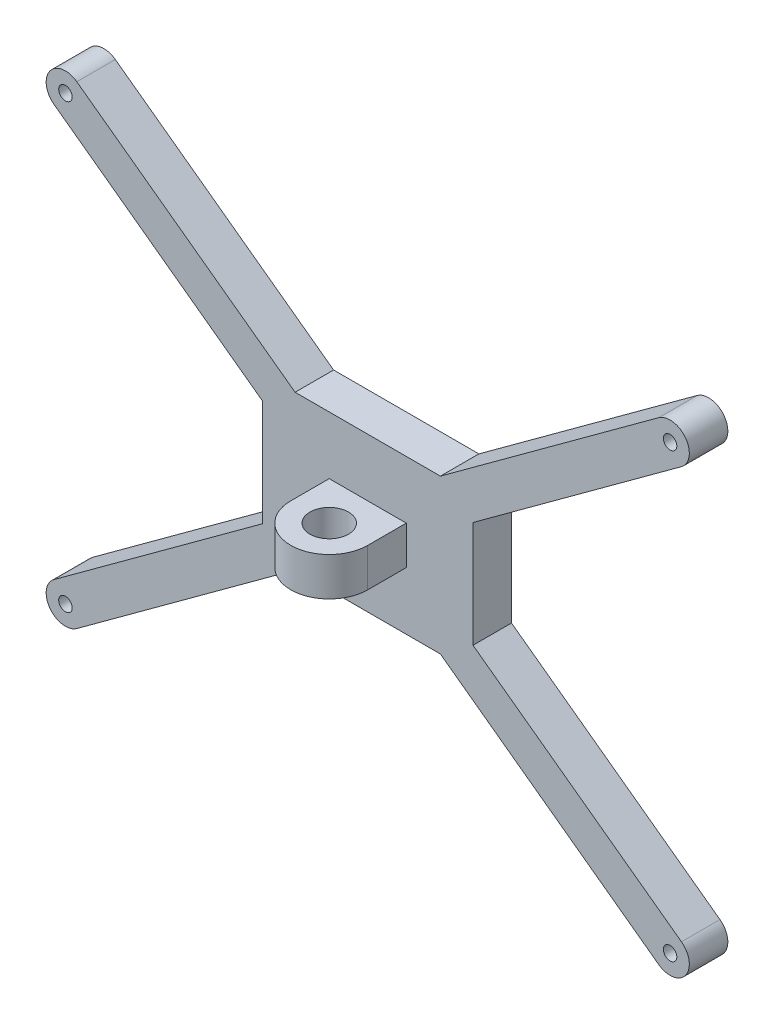
ISO-10303-21;
HEADER;
FILE_DESCRIPTION(('STEP AP214'),'2;1');
FILE_NAME('part.step','',(''),(''),'','','');
FILE_SCHEMA(('AUTOMOTIVE_DESIGN { 1 0 10303 214 1 1 1 1 }'));
ENDSEC;
DATA;
#1=APPLICATION_CONTEXT('core data for automotive mechanical design processes');
#2=APPLICATION_PROTOCOL_DEFINITION('international standard','automotive_design',2000,#1);
#3=PRODUCT_CONTEXT('',#1,'mechanical');
#4=PRODUCT('Part','Part','',(#3));
#5=PRODUCT_RELATED_PRODUCT_CATEGORY('part','',(#4));
#6=PRODUCT_DEFINITION_FORMATION('','',#4);
#7=PRODUCT_DEFINITION_CONTEXT('part definition',#1,'design');
#8=PRODUCT_DEFINITION('design','',#6,#7);
#9=PRODUCT_DEFINITION_SHAPE('','',#8);
#10=(LENGTH_UNIT() NAMED_UNIT(*) SI_UNIT(.MILLI.,.METRE.));
#11=(NAMED_UNIT(*) PLANE_ANGLE_UNIT() SI_UNIT($,.RADIAN.));
#12=(NAMED_UNIT(*) SI_UNIT($,.STERADIAN.) SOLID_ANGLE_UNIT());
#13=UNCERTAINTY_MEASURE_WITH_UNIT(LENGTH_MEASURE(1.E-05),#10,'distance_accuracy_value','');
#14=(GEOMETRIC_REPRESENTATION_CONTEXT(3) GLOBAL_UNCERTAINTY_ASSIGNED_CONTEXT((#13)) GLOBAL_UNIT_ASSIGNED_CONTEXT((#10,
#11,#12)) REPRESENTATION_CONTEXT('',''));
#15=CARTESIAN_POINT('',(0.,0.,0.));
#16=DIRECTION('',(0.,0.,1.));
#17=DIRECTION('',(1.,0.,0.));
#18=AXIS2_PLACEMENT_3D('',#15,#16,#17);
#19=CARTESIAN_POINT('',(157.,0.,10.));
#20=DIRECTION('',(0.,0.,1.));
#21=DIRECTION('',(1.,0.,0.));
#22=AXIS2_PLACEMENT_3D('',#19,#20,#21);
#23=PLANE('',#22);
#24=CARTESIAN_POINT('',(157.,0.,10.));
#25=DIRECTION('',(0.,0.,1.));
#26=DIRECTION('',(1.,0.,0.));
#27=AXIS2_PLACEMENT_3D('',#24,#25,#26);
#28=CIRCLE('',#27,1.75000000000001);
#29=CARTESIAN_POINT('',(158.75,0.,10.));
#30=VERTEX_POINT('',#29);
#31=EDGE_CURVE('E380',#30,#30,#28,.T.);
#32=ORIENTED_EDGE('',*,*,#31,.F.);
#33=EDGE_LOOP('',(#32));
#34=FACE_BOUND('',#33,.T.);
#35=CARTESIAN_POINT('',(0.,0.,10.));
#36=DIRECTION('',(0.,0.,1.));
#37=DIRECTION('',(1.,0.,0.));
#38=AXIS2_PLACEMENT_3D('',#35,#36,#37);
#39=CIRCLE('',#38,1.75);
#40=CARTESIAN_POINT('',(1.75,0.,10.));
#41=VERTEX_POINT('',#40);
#42=EDGE_CURVE('E206',#41,#41,#39,.T.);
#43=ORIENTED_EDGE('',*,*,#42,.F.);
#44=EDGE_LOOP('',(#43));
#45=FACE_BOUND('',#44,.T.);
#46=DIRECTION('',(-0.806976552685841,0.590583477093015,0.));
#47=VECTOR('',#46,1.);
#48=CARTESIAN_POINT('',(105.828111401218,43.6459668882059,10.));
#49=LINE('',#48,#47);
#50=CARTESIAN_POINT('',(159.952917385465,4.03488276342919,10.));
#51=VERTEX_POINT('',#50);
#52=CARTESIAN_POINT('',(105.828111401218,43.6459668882059,10.));
#53=VERTEX_POINT('',#52);
#54=EDGE_CURVE('E249',#51,#53,#49,.T.);
#55=ORIENTED_EDGE('',*,*,#54,.T.);
#56=DIRECTION('',(0.,1.,0.));
#57=VECTOR('',#56,1.);
#58=CARTESIAN_POINT('',(105.828111401218,43.6459668882059,10.));
#59=LINE('',#58,#57);
#60=CARTESIAN_POINT('',(105.828111401218,71.2540331117941,10.));
#61=VERTEX_POINT('',#60);
#62=EDGE_CURVE('E129',#53,#61,#59,.T.);
#63=ORIENTED_EDGE('',*,*,#62,.T.);
#64=DIRECTION('',(0.806976552685841,0.590583477093015,0.));
#65=VECTOR('',#64,1.);
#66=CARTESIAN_POINT('',(159.952917385465,110.865117236571,10.));
#67=LINE('',#66,#65);
#68=CARTESIAN_POINT('',(159.952917385465,110.865117236571,10.));
#69=VERTEX_POINT('',#68);
#70=EDGE_CURVE('E302',#61,#69,#67,.T.);
#71=ORIENTED_EDGE('',*,*,#70,.T.);
#72=CARTESIAN_POINT('',(157.,114.9,10.));
#73=DIRECTION('',(0.,0.,1.));
#74=DIRECTION('',(1.,0.,0.));
#75=AXIS2_PLACEMENT_3D('',#72,#73,#74);
#76=CIRCLE('',#75,4.99999999999994);
#77=CARTESIAN_POINT('',(154.047082614535,118.934882763429,10.));
#78=VERTEX_POINT('',#77);
#79=EDGE_CURVE('E322',#69,#78,#76,.T.);
#80=ORIENTED_EDGE('',*,*,#79,.T.);
#81=DIRECTION('',(-0.806976552685842,-0.590583477093013,0.));
#82=VECTOR('',#81,1.);
#83=CARTESIAN_POINT('',(154.047082614535,118.934882763429,10.));
#84=LINE('',#83,#82);
#85=CARTESIAN_POINT('',(97.3619077332609,77.45,10.));
#86=VERTEX_POINT('',#85);
#87=EDGE_CURVE('E318',#78,#86,#84,.T.);
#88=ORIENTED_EDGE('',*,*,#87,.T.);
#89=DIRECTION('',(-1.,0.,0.));
#90=VECTOR('',#89,1.);
#91=CARTESIAN_POINT('',(59.6380922667391,77.45,10.));
#92=LINE('',#91,#90);
#93=CARTESIAN_POINT('',(59.6380922667391,77.45,10.));
#94=VERTEX_POINT('',#93);
#95=EDGE_CURVE('E321',#86,#94,#92,.T.);
#96=ORIENTED_EDGE('',*,*,#95,.T.);
#97=DIRECTION('',(-0.806976552685842,0.590583477093014,0.));
#98=VECTOR('',#97,1.);
#99=CARTESIAN_POINT('',(2.95291738546507,118.934882763429,10.));
#100=LINE('',#99,#98);
#101=CARTESIAN_POINT('',(2.95291738546507,118.934882763429,10.));
#102=VERTEX_POINT('',#101);
#103=EDGE_CURVE('E326',#94,#102,#100,.T.);
#104=ORIENTED_EDGE('',*,*,#103,.T.);
#105=CARTESIAN_POINT('',(0.,114.9,10.));
#106=DIRECTION('',(0.,0.,1.));
#107=DIRECTION('',(1.,0.,0.));
#108=AXIS2_PLACEMENT_3D('',#105,#106,#107);
#109=CIRCLE('',#108,4.99999999999999);
#110=CARTESIAN_POINT('',(-2.95291738546507,110.865117236571,10.));
#111=VERTEX_POINT('',#110);
#112=EDGE_CURVE('E333',#102,#111,#109,.T.);
#113=ORIENTED_EDGE('',*,*,#112,.T.);
#114=DIRECTION('',(0.806976552685842,-0.590583477093014,0.));
#115=VECTOR('',#114,1.);
#116=CARTESIAN_POINT('',(-2.95291738546506,110.865117236571,10.));
#117=LINE('',#116,#115);
#118=CARTESIAN_POINT('',(51.1718885987816,71.2540331117941,10.));
#119=VERTEX_POINT('',#118);
#120=EDGE_CURVE('E336',#111,#119,#117,.T.);
#121=ORIENTED_EDGE('',*,*,#120,.T.);
#122=DIRECTION('',(0.,-1.,0.));
#123=VECTOR('',#122,1.);
#124=CARTESIAN_POINT('',(51.1718885987816,43.6459668882059,10.));
#125=LINE('',#124,#123);
#126=CARTESIAN_POINT('',(51.1718885987816,43.6459668882059,10.));
#127=VERTEX_POINT('',#126);
#128=EDGE_CURVE('E339',#119,#127,#125,.T.);
#129=ORIENTED_EDGE('',*,*,#128,.T.);
#130=DIRECTION('',(-0.806976552685842,-0.590583477093014,0.));
#131=VECTOR('',#130,1.);
#132=CARTESIAN_POINT('',(51.1718885987816,43.6459668882059,10.));
#133=LINE('',#132,#131);
#134=CARTESIAN_POINT('',(-2.95291738546507,4.0348827634292,10.));
#135=VERTEX_POINT('',#134);
#136=EDGE_CURVE('E342',#127,#135,#133,.T.);
#137=ORIENTED_EDGE('',*,*,#136,.T.);
#138=CARTESIAN_POINT('',(0.,0.,10.));
#139=DIRECTION('',(0.,0.,1.));
#140=DIRECTION('',(1.,0.,0.));
#141=AXIS2_PLACEMENT_3D('',#138,#139,#140);
#142=CIRCLE('',#141,5.);
#143=CARTESIAN_POINT('',(2.95291738546507,-4.03488276342921,10.));
#144=VERTEX_POINT('',#143);
#145=EDGE_CURVE('E345',#135,#144,#142,.T.);
#146=ORIENTED_EDGE('',*,*,#145,.T.);
#147=DIRECTION('',(0.806976552685842,0.590583477093014,0.));
#148=VECTOR('',#147,1.);
#149=CARTESIAN_POINT('',(59.6380922667391,37.45,10.));
#150=LINE('',#149,#148);
#151=CARTESIAN_POINT('',(59.6380922667391,37.45,10.));
#152=VERTEX_POINT('',#151);
#153=EDGE_CURVE('E176',#144,#152,#150,.T.);
#154=ORIENTED_EDGE('',*,*,#153,.T.);
#155=DIRECTION('',(1.,0.,0.));
#156=VECTOR('',#155,1.);
#157=CARTESIAN_POINT('',(59.6380922667391,37.45,10.));
#158=LINE('',#157,#156);
#159=CARTESIAN_POINT('',(97.3619077332609,37.45,10.));
#160=VERTEX_POINT('',#159);
#161=EDGE_CURVE('E169',#152,#160,#158,.T.);
#162=ORIENTED_EDGE('',*,*,#161,.T.);
#163=DIRECTION('',(0.806976552685842,-0.590583477093014,0.));
#164=VECTOR('',#163,1.);
#165=CARTESIAN_POINT('',(97.3619077332609,37.45,10.));
#166=LINE('',#165,#164);
#167=CARTESIAN_POINT('',(154.047082614535,-4.03488276342918,10.));
#168=VERTEX_POINT('',#167);
#169=EDGE_CURVE('E173',#160,#168,#166,.T.);
#170=ORIENTED_EDGE('',*,*,#169,.T.);
#171=CARTESIAN_POINT('',(157.,0.,10.));
#172=DIRECTION('',(0.,0.,1.));
#173=DIRECTION('',(1.,0.,0.));
#174=AXIS2_PLACEMENT_3D('',#171,#172,#173);
#175=CIRCLE('',#174,4.99999999999997);
#176=EDGE_CURVE('E64',#168,#51,#175,.T.);
#177=ORIENTED_EDGE('',*,*,#176,.T.);
#178=EDGE_LOOP('',(#55,#63,#71,#80,#88,#96,#104,#113,#121,#129,#137,#146,#154,#162,#170,#177));
#179=FACE_BOUND('',#178,.T.);
#180=CARTESIAN_POINT('',(0.,114.9,10.));
#181=DIRECTION('',(0.,0.,1.));
#182=DIRECTION('',(1.,0.,0.));
#183=AXIS2_PLACEMENT_3D('',#180,#181,#182);
#184=CIRCLE('',#183,1.75);
#185=CARTESIAN_POINT('',(1.75,114.9,10.));
#186=VERTEX_POINT('',#185);
#187=EDGE_CURVE('E372',#186,#186,#184,.T.);
#188=ORIENTED_EDGE('',*,*,#187,.F.);
#189=EDGE_LOOP('',(#188));
#190=FACE_BOUND('',#189,.T.);
#191=CARTESIAN_POINT('',(157.,114.9,10.));
#192=DIRECTION('',(0.,0.,1.));
#193=DIRECTION('',(1.,0.,0.));
#194=AXIS2_PLACEMENT_3D('',#191,#192,#193);
#195=CIRCLE('',#194,1.75000000000001);
#196=CARTESIAN_POINT('',(158.75,114.9,10.));
#197=VERTEX_POINT('',#196);
#198=EDGE_CURVE('E388',#197,#197,#195,.T.);
#199=ORIENTED_EDGE('',*,*,#198,.F.);
#200=EDGE_LOOP('',(#199));
#201=FACE_BOUND('',#200,.T.);
#202=DIRECTION('',(-1.,0.,0.));
#203=VECTOR('',#202,1.);
#204=CARTESIAN_POINT('',(88.5,62.45,9.99999999999999));
#205=LINE('',#204,#203);
#206=CARTESIAN_POINT('',(88.5,62.45,9.99999999999999));
#207=VERTEX_POINT('',#206);
#208=CARTESIAN_POINT('',(68.5,62.45,10.));
#209=VERTEX_POINT('',#208);
#210=EDGE_CURVE('E434',#207,#209,#205,.T.);
#211=ORIENTED_EDGE('',*,*,#210,.F.);
#212=DIRECTION('',(0.,-1.,0.));
#213=VECTOR('',#212,1.);
#214=CARTESIAN_POINT('',(88.5,62.45,9.99999999999999));
#215=LINE('',#214,#213);
#216=CARTESIAN_POINT('',(88.5,52.45,9.99999999999999));
#217=VERTEX_POINT('',#216);
#218=EDGE_CURVE('E403',#207,#217,#215,.T.);
#219=ORIENTED_EDGE('',*,*,#218,.T.);
#220=DIRECTION('',(-1.,0.,0.));
#221=VECTOR('',#220,1.);
#222=CARTESIAN_POINT('',(88.5,52.45,9.99999999999999));
#223=LINE('',#222,#221);
#224=CARTESIAN_POINT('',(68.5,52.45,9.99999999999999));
#225=VERTEX_POINT('',#224);
#226=EDGE_CURVE('E419',#217,#225,#223,.T.);
#227=ORIENTED_EDGE('',*,*,#226,.T.);
#228=DIRECTION('',(0.,-1.,0.));
#229=VECTOR('',#228,1.);
#230=CARTESIAN_POINT('',(68.5,62.45,9.99999999999999));
#231=LINE('',#230,#229);
#232=EDGE_CURVE('E407',#209,#225,#231,.T.);
#233=ORIENTED_EDGE('',*,*,#232,.F.);
#234=EDGE_LOOP('',(#211,#219,#227,#233));
#235=FACE_BOUND('',#234,.T.);
#236=ADVANCED_FACE('F39',(#34,#45,#179,#190,#201,#235),#23,.T.);
#237=CARTESIAN_POINT('',(157.,0.,0.));
#238=DIRECTION('',(0.,0.,1.));
#239=DIRECTION('',(1.,0.,0.));
#240=AXIS2_PLACEMENT_3D('',#237,#238,#239);
#241=PLANE('',#240);
#242=DIRECTION('',(-0.806976552685841,0.590583477093015,0.));
#243=VECTOR('',#242,1.);
#244=CARTESIAN_POINT('',(105.828111401218,43.6459668882059,0.));
#245=LINE('',#244,#243);
#246=CARTESIAN_POINT('',(159.952917385465,4.03488276342919,0.));
#247=VERTEX_POINT('',#246);
#248=CARTESIAN_POINT('',(105.828111401218,43.6459668882059,0.));
#249=VERTEX_POINT('',#248);
#250=EDGE_CURVE('E201',#247,#249,#245,.T.);
#251=ORIENTED_EDGE('',*,*,#250,.F.);
#252=CARTESIAN_POINT('',(157.,0.,0.));
#253=DIRECTION('',(0.,0.,1.));
#254=DIRECTION('',(1.,0.,0.));
#255=AXIS2_PLACEMENT_3D('',#252,#253,#254);
#256=CIRCLE('',#255,4.99999999999997);
#257=CARTESIAN_POINT('',(154.047082614535,-4.03488276342918,0.));
#258=VERTEX_POINT('',#257);
#259=EDGE_CURVE('E121',#258,#247,#256,.T.);
#260=ORIENTED_EDGE('',*,*,#259,.F.);
#261=DIRECTION('',(0.806976552685842,-0.590583477093014,0.));
#262=VECTOR('',#261,1.);
#263=CARTESIAN_POINT('',(97.3619077332609,37.45,0.));
#264=LINE('',#263,#262);
#265=CARTESIAN_POINT('',(97.3619077332609,37.45,0.));
#266=VERTEX_POINT('',#265);
#267=EDGE_CURVE('E244',#266,#258,#264,.T.);
#268=ORIENTED_EDGE('',*,*,#267,.F.);
#269=DIRECTION('',(1.,0.,0.));
#270=VECTOR('',#269,1.);
#271=CARTESIAN_POINT('',(59.6380922667391,37.45,0.));
#272=LINE('',#271,#270);
#273=CARTESIAN_POINT('',(59.6380922667391,37.45,0.));
#274=VERTEX_POINT('',#273);
#275=EDGE_CURVE('E186',#274,#266,#272,.T.);
#276=ORIENTED_EDGE('',*,*,#275,.F.);
#277=DIRECTION('',(0.806976552685842,0.590583477093014,0.));
#278=VECTOR('',#277,1.);
#279=CARTESIAN_POINT('',(59.6380922667391,37.45,0.));
#280=LINE('',#279,#278);
#281=CARTESIAN_POINT('',(2.95291738546507,-4.03488276342921,0.));
#282=VERTEX_POINT('',#281);
#283=EDGE_CURVE('E239',#282,#274,#280,.T.);
#284=ORIENTED_EDGE('',*,*,#283,.F.);
#285=CARTESIAN_POINT('',(0.,0.,0.));
#286=DIRECTION('',(0.,0.,1.));
#287=DIRECTION('',(1.,0.,0.));
#288=AXIS2_PLACEMENT_3D('',#285,#286,#287);
#289=CIRCLE('',#288,5.);
#290=CARTESIAN_POINT('',(-2.95291738546507,4.0348827634292,0.));
#291=VERTEX_POINT('',#290);
#292=EDGE_CURVE('E236',#291,#282,#289,.T.);
#293=ORIENTED_EDGE('',*,*,#292,.F.);
#294=DIRECTION('',(-0.806976552685842,-0.590583477093014,0.));
#295=VECTOR('',#294,1.);
#296=CARTESIAN_POINT('',(51.1718885987816,43.6459668882059,0.));
#297=LINE('',#296,#295);
#298=CARTESIAN_POINT('',(51.1718885987816,43.6459668882059,0.));
#299=VERTEX_POINT('',#298);
#300=EDGE_CURVE('E233',#299,#291,#297,.T.);
#301=ORIENTED_EDGE('',*,*,#300,.F.);
#302=DIRECTION('',(0.,-1.,0.));
#303=VECTOR('',#302,1.);
#304=CARTESIAN_POINT('',(51.1718885987816,43.6459668882059,0.));
#305=LINE('',#304,#303);
#306=CARTESIAN_POINT('',(51.1718885987816,71.2540331117941,0.));
#307=VERTEX_POINT('',#306);
#308=EDGE_CURVE('E230',#307,#299,#305,.T.);
#309=ORIENTED_EDGE('',*,*,#308,.F.);
#310=DIRECTION('',(0.806976552685842,-0.590583477093014,0.));
#311=VECTOR('',#310,1.);
#312=CARTESIAN_POINT('',(-2.95291738546506,110.865117236571,0.));
#313=LINE('',#312,#311);
#314=CARTESIAN_POINT('',(-2.95291738546507,110.865117236571,0.));
#315=VERTEX_POINT('',#314);
#316=EDGE_CURVE('E227',#315,#307,#313,.T.);
#317=ORIENTED_EDGE('',*,*,#316,.F.);
#318=CARTESIAN_POINT('',(0.,114.9,0.));
#319=DIRECTION('',(0.,0.,1.));
#320=DIRECTION('',(1.,0.,0.));
#321=AXIS2_PLACEMENT_3D('',#318,#319,#320);
#322=CIRCLE('',#321,4.99999999999999);
#323=CARTESIAN_POINT('',(2.95291738546507,118.934882763429,0.));
#324=VERTEX_POINT('',#323);
#325=EDGE_CURVE('E224',#324,#315,#322,.T.);
#326=ORIENTED_EDGE('',*,*,#325,.F.);
#327=DIRECTION('',(-0.806976552685842,0.590583477093014,0.));
#328=VECTOR('',#327,1.);
#329=CARTESIAN_POINT('',(2.95291738546507,118.934882763429,0.));
#330=LINE('',#329,#328);
#331=CARTESIAN_POINT('',(59.6380922667391,77.45,0.));
#332=VERTEX_POINT('',#331);
#333=EDGE_CURVE('E221',#332,#324,#330,.T.);
#334=ORIENTED_EDGE('',*,*,#333,.F.);
#335=DIRECTION('',(-1.,0.,0.));
#336=VECTOR('',#335,1.);
#337=CARTESIAN_POINT('',(59.6380922667391,77.45,0.));
#338=LINE('',#337,#336);
#339=CARTESIAN_POINT('',(97.3619077332609,77.45,0.));
#340=VERTEX_POINT('',#339);
#341=EDGE_CURVE('E218',#340,#332,#338,.T.);
#342=ORIENTED_EDGE('',*,*,#341,.F.);
#343=DIRECTION('',(-0.806976552685842,-0.590583477093013,0.));
#344=VECTOR('',#343,1.);
#345=CARTESIAN_POINT('',(154.047082614535,118.934882763429,0.));
#346=LINE('',#345,#344);
#347=CARTESIAN_POINT('',(154.047082614535,118.934882763429,0.));
#348=VERTEX_POINT('',#347);
#349=EDGE_CURVE('E215',#348,#340,#346,.T.);
#350=ORIENTED_EDGE('',*,*,#349,.F.);
#351=CARTESIAN_POINT('',(157.,114.9,0.));
#352=DIRECTION('',(0.,0.,1.));
#353=DIRECTION('',(1.,0.,0.));
#354=AXIS2_PLACEMENT_3D('',#351,#352,#353);
#355=CIRCLE('',#354,4.99999999999994);
#356=CARTESIAN_POINT('',(159.952917385465,110.865117236571,0.));
#357=VERTEX_POINT('',#356);
#358=EDGE_CURVE('E212',#357,#348,#355,.T.);
#359=ORIENTED_EDGE('',*,*,#358,.F.);
#360=DIRECTION('',(0.806976552685841,0.590583477093015,0.));
#361=VECTOR('',#360,1.);
#362=CARTESIAN_POINT('',(159.952917385465,110.865117236571,0.));
#363=LINE('',#362,#361);
#364=CARTESIAN_POINT('',(105.828111401218,71.2540331117941,0.));
#365=VERTEX_POINT('',#364);
#366=EDGE_CURVE('E209',#365,#357,#363,.T.);
#367=ORIENTED_EDGE('',*,*,#366,.F.);
#368=DIRECTION('',(0.,1.,0.));
#369=VECTOR('',#368,1.);
#370=CARTESIAN_POINT('',(105.828111401218,43.6459668882059,0.));
#371=LINE('',#370,#369);
#372=EDGE_CURVE('E205',#249,#365,#371,.T.);
#373=ORIENTED_EDGE('',*,*,#372,.F.);
#374=EDGE_LOOP('',(#251,#260,#268,#276,#284,#293,#301,#309,#317,#326,#334,#342,#350,#359,#367,#373));
#375=FACE_BOUND('',#374,.T.);
#376=CARTESIAN_POINT('',(0.,0.,0.));
#377=DIRECTION('',(0.,0.,1.));
#378=DIRECTION('',(1.,0.,0.));
#379=AXIS2_PLACEMENT_3D('',#376,#377,#378);
#380=CIRCLE('',#379,1.75);
#381=CARTESIAN_POINT('',(1.75,0.,0.));
#382=VERTEX_POINT('',#381);
#383=EDGE_CURVE('E367',#382,#382,#380,.T.);
#384=ORIENTED_EDGE('',*,*,#383,.T.);
#385=EDGE_LOOP('',(#384));
#386=FACE_BOUND('',#385,.T.);
#387=CARTESIAN_POINT('',(0.,114.9,0.));
#388=DIRECTION('',(0.,0.,1.));
#389=DIRECTION('',(1.,0.,0.));
#390=AXIS2_PLACEMENT_3D('',#387,#388,#389);
#391=CIRCLE('',#390,1.75);
#392=CARTESIAN_POINT('',(1.75,114.9,0.));
#393=VERTEX_POINT('',#392);
#394=EDGE_CURVE('E376',#393,#393,#391,.T.);
#395=ORIENTED_EDGE('',*,*,#394,.T.);
#396=EDGE_LOOP('',(#395));
#397=FACE_BOUND('',#396,.T.);
#398=CARTESIAN_POINT('',(157.,0.,0.));
#399=DIRECTION('',(0.,0.,1.));
#400=DIRECTION('',(1.,0.,0.));
#401=AXIS2_PLACEMENT_3D('',#398,#399,#400);
#402=CIRCLE('',#401,1.75000000000001);
#403=CARTESIAN_POINT('',(158.75,0.,0.));
#404=VERTEX_POINT('',#403);
#405=EDGE_CURVE('E384',#404,#404,#402,.T.);
#406=ORIENTED_EDGE('',*,*,#405,.T.);
#407=EDGE_LOOP('',(#406));
#408=FACE_BOUND('',#407,.T.);
#409=CARTESIAN_POINT('',(157.,114.9,0.));
#410=DIRECTION('',(0.,0.,1.));
#411=DIRECTION('',(1.,0.,0.));
#412=AXIS2_PLACEMENT_3D('',#409,#410,#411);
#413=CIRCLE('',#412,1.75000000000001);
#414=CARTESIAN_POINT('',(158.75,114.9,0.));
#415=VERTEX_POINT('',#414);
#416=EDGE_CURVE('E392',#415,#415,#413,.T.);
#417=ORIENTED_EDGE('',*,*,#416,.T.);
#418=EDGE_LOOP('',(#417));
#419=FACE_BOUND('',#418,.T.);
#420=ADVANCED_FACE('F306',(#375,#386,#397,#408,#419),#241,.F.);
#421=CARTESIAN_POINT('',(105.828111401218,43.6459668882059,10.));
#422=DIRECTION('',(-0.590583477093015,-0.806976552685841,0.));
#423=DIRECTION('',(0.806976552685841,-0.590583477093015,0.));
#424=AXIS2_PLACEMENT_3D('',#421,#422,#423);
#425=PLANE('',#424);
#426=ORIENTED_EDGE('',*,*,#250,.T.);
#427=DIRECTION('',(0.,0.,-1.));
#428=VECTOR('',#427,1.);
#429=CARTESIAN_POINT('',(105.828111401218,43.6459668882059,10.));
#430=LINE('',#429,#428);
#431=EDGE_CURVE('E11',#53,#249,#430,.T.);
#432=ORIENTED_EDGE('',*,*,#431,.F.);
#433=ORIENTED_EDGE('',*,*,#54,.F.);
#434=DIRECTION('',(0.,0.,-1.));
#435=VECTOR('',#434,1.);
#436=CARTESIAN_POINT('',(159.952917385465,4.03488276342919,10.));
#437=LINE('',#436,#435);
#438=EDGE_CURVE('E197',#51,#247,#437,.T.);
#439=ORIENTED_EDGE('',*,*,#438,.T.);
#440=EDGE_LOOP('',(#426,#432,#433,#439));
#441=FACE_BOUND('',#440,.T.);
#442=ADVANCED_FACE('F41',(#441),#425,.F.);
#443=CARTESIAN_POINT('',(105.828111401218,43.6459668882059,10.));
#444=DIRECTION('',(-1.,0.,0.));
#445=DIRECTION('',(0.,0.,1.));
#446=AXIS2_PLACEMENT_3D('',#443,#444,#445);
#447=PLANE('',#446);
#448=ORIENTED_EDGE('',*,*,#372,.T.);
#449=DIRECTION('',(0.,0.,-1.));
#450=VECTOR('',#449,1.);
#451=CARTESIAN_POINT('',(105.828111401218,71.2540331117941,10.));
#452=LINE('',#451,#450);
#453=EDGE_CURVE('E48',#61,#365,#452,.T.);
#454=ORIENTED_EDGE('',*,*,#453,.F.);
#455=ORIENTED_EDGE('',*,*,#62,.F.);
#456=ORIENTED_EDGE('',*,*,#431,.T.);
#457=EDGE_LOOP('',(#448,#454,#455,#456));
#458=FACE_BOUND('',#457,.T.);
#459=ADVANCED_FACE('F524',(#458),#447,.F.);
#460=CARTESIAN_POINT('',(159.952917385465,110.865117236571,10.));
#461=DIRECTION('',(-0.590583477093015,0.806976552685841,0.));
#462=DIRECTION('',(-0.806976552685841,-0.590583477093015,0.));
#463=AXIS2_PLACEMENT_3D('',#460,#461,#462);
#464=PLANE('',#463);
#465=ORIENTED_EDGE('',*,*,#366,.T.);
#466=DIRECTION('',(0.,0.,-1.));
#467=VECTOR('',#466,1.);
#468=CARTESIAN_POINT('',(159.952917385465,110.865117236571,10.));
#469=LINE('',#468,#467);
#470=EDGE_CURVE('E292',#69,#357,#469,.T.);
#471=ORIENTED_EDGE('',*,*,#470,.F.);
#472=ORIENTED_EDGE('',*,*,#70,.F.);
#473=ORIENTED_EDGE('',*,*,#453,.T.);
#474=EDGE_LOOP('',(#465,#471,#472,#473));
#475=FACE_BOUND('',#474,.T.);
#476=ADVANCED_FACE('F300',(#475),#464,.F.);
#477=CARTESIAN_POINT('',(157.,114.9,10.));
#478=DIRECTION('',(0.,0.,-1.));
#479=DIRECTION('',(-1.,0.,0.));
#480=AXIS2_PLACEMENT_3D('',#477,#478,#479);
#481=CYLINDRICAL_SURFACE('',#480,4.99999999999994);
#482=ORIENTED_EDGE('',*,*,#358,.T.);
#483=DIRECTION('',(0.,0.,-1.));
#484=VECTOR('',#483,1.);
#485=CARTESIAN_POINT('',(154.047082614535,118.934882763429,10.));
#486=LINE('',#485,#484);
#487=EDGE_CURVE('E288',#78,#348,#486,.T.);
#488=ORIENTED_EDGE('',*,*,#487,.F.);
#489=ORIENTED_EDGE('',*,*,#79,.F.);
#490=ORIENTED_EDGE('',*,*,#470,.T.);
#491=EDGE_LOOP('',(#482,#488,#489,#490));
#492=FACE_BOUND('',#491,.T.);
#493=ADVANCED_FACE('F312',(#492),#481,.T.);
#494=CARTESIAN_POINT('',(154.047082614535,118.934882763429,10.));
#495=DIRECTION('',(0.590583477093013,-0.806976552685842,0.));
#496=DIRECTION('',(0.806976552685842,0.590583477093013,0.));
#497=AXIS2_PLACEMENT_3D('',#494,#495,#496);
#498=PLANE('',#497);
#499=ORIENTED_EDGE('',*,*,#349,.T.);
#500=DIRECTION('',(0.,0.,-1.));
#501=VECTOR('',#500,1.);
#502=CARTESIAN_POINT('',(97.3619077332609,77.45,10.));
#503=LINE('',#502,#501);
#504=EDGE_CURVE('E284',#86,#340,#503,.T.);
#505=ORIENTED_EDGE('',*,*,#504,.F.);
#506=ORIENTED_EDGE('',*,*,#87,.F.);
#507=ORIENTED_EDGE('',*,*,#487,.T.);
#508=EDGE_LOOP('',(#499,#505,#506,#507));
#509=FACE_BOUND('',#508,.T.);
#510=ADVANCED_FACE('F316',(#509),#498,.F.);
#511=CARTESIAN_POINT('',(59.6380922667391,77.45,10.));
#512=DIRECTION('',(0.,-1.,0.));
#513=DIRECTION('',(0.,0.,-1.));
#514=AXIS2_PLACEMENT_3D('',#511,#512,#513);
#515=PLANE('',#514);
#516=ORIENTED_EDGE('',*,*,#341,.T.);
#517=DIRECTION('',(0.,0.,-1.));
#518=VECTOR('',#517,1.);
#519=CARTESIAN_POINT('',(59.6380922667391,77.45,10.));
#520=LINE('',#519,#518);
#521=EDGE_CURVE('E280',#94,#332,#520,.T.);
#522=ORIENTED_EDGE('',*,*,#521,.F.);
#523=ORIENTED_EDGE('',*,*,#95,.F.);
#524=ORIENTED_EDGE('',*,*,#504,.T.);
#525=EDGE_LOOP('',(#516,#522,#523,#524));
#526=FACE_BOUND('',#525,.T.);
#527=ADVANCED_FACE('F514',(#526),#515,.F.);
#528=CARTESIAN_POINT('',(2.95291738546507,118.934882763429,10.));
#529=DIRECTION('',(-0.590583477093014,-0.806976552685842,0.));
#530=DIRECTION('',(0.806976552685842,-0.590583477093014,0.));
#531=AXIS2_PLACEMENT_3D('',#528,#529,#530);
#532=PLANE('',#531);
#533=ORIENTED_EDGE('',*,*,#333,.T.);
#534=DIRECTION('',(0.,0.,-1.));
#535=VECTOR('',#534,1.);
#536=CARTESIAN_POINT('',(2.95291738546507,118.934882763429,10.));
#537=LINE('',#536,#535);
#538=EDGE_CURVE('E276',#102,#324,#537,.T.);
#539=ORIENTED_EDGE('',*,*,#538,.F.);
#540=ORIENTED_EDGE('',*,*,#103,.F.);
#541=ORIENTED_EDGE('',*,*,#521,.T.);
#542=EDGE_LOOP('',(#533,#539,#540,#541));
#543=FACE_BOUND('',#542,.T.);
#544=ADVANCED_FACE('F510',(#543),#532,.F.);
#545=CARTESIAN_POINT('',(0.,114.9,10.));
#546=DIRECTION('',(0.,0.,-1.));
#547=DIRECTION('',(-1.,0.,0.));
#548=AXIS2_PLACEMENT_3D('',#545,#546,#547);
#549=CYLINDRICAL_SURFACE('',#548,4.99999999999999);
#550=ORIENTED_EDGE('',*,*,#325,.T.);
#551=DIRECTION('',(0.,0.,-1.));
#552=VECTOR('',#551,1.);
#553=CARTESIAN_POINT('',(-2.95291738546507,110.865117236571,10.));
#554=LINE('',#553,#552);
#555=EDGE_CURVE('E272',#111,#315,#554,.T.);
#556=ORIENTED_EDGE('',*,*,#555,.F.);
#557=ORIENTED_EDGE('',*,*,#112,.F.);
#558=ORIENTED_EDGE('',*,*,#538,.T.);
#559=EDGE_LOOP('',(#550,#556,#557,#558));
#560=FACE_BOUND('',#559,.T.);
#561=ADVANCED_FACE('F506',(#560),#549,.T.);
#562=CARTESIAN_POINT('',(-2.95291738546506,110.865117236571,10.));
#563=DIRECTION('',(0.590583477093014,0.806976552685842,0.));
#564=DIRECTION('',(-0.806976552685842,0.590583477093014,0.));
#565=AXIS2_PLACEMENT_3D('',#562,#563,#564);
#566=PLANE('',#565);
#567=ORIENTED_EDGE('',*,*,#316,.T.);
#568=DIRECTION('',(0.,0.,-1.));
#569=VECTOR('',#568,1.);
#570=CARTESIAN_POINT('',(51.1718885987816,71.2540331117941,10.));
#571=LINE('',#570,#569);
#572=EDGE_CURVE('E268',#119,#307,#571,.T.);
#573=ORIENTED_EDGE('',*,*,#572,.F.);
#574=ORIENTED_EDGE('',*,*,#120,.F.);
#575=ORIENTED_EDGE('',*,*,#555,.T.);
#576=EDGE_LOOP('',(#567,#573,#574,#575));
#577=FACE_BOUND('',#576,.T.);
#578=ADVANCED_FACE('F502',(#577),#566,.F.);
#579=CARTESIAN_POINT('',(51.1718885987816,43.6459668882059,10.));
#580=DIRECTION('',(1.,0.,0.));
#581=DIRECTION('',(0.,0.,-1.));
#582=AXIS2_PLACEMENT_3D('',#579,#580,#581);
#583=PLANE('',#582);
#584=ORIENTED_EDGE('',*,*,#308,.T.);
#585=DIRECTION('',(0.,0.,-1.));
#586=VECTOR('',#585,1.);
#587=CARTESIAN_POINT('',(51.1718885987816,43.6459668882059,10.));
#588=LINE('',#587,#586);
#589=EDGE_CURVE('E264',#127,#299,#588,.T.);
#590=ORIENTED_EDGE('',*,*,#589,.F.);
#591=ORIENTED_EDGE('',*,*,#128,.F.);
#592=ORIENTED_EDGE('',*,*,#572,.T.);
#593=EDGE_LOOP('',(#584,#590,#591,#592));
#594=FACE_BOUND('',#593,.T.);
#595=ADVANCED_FACE('F498',(#594),#583,.F.);
#596=CARTESIAN_POINT('',(51.1718885987816,43.6459668882059,10.));
#597=DIRECTION('',(0.590583477093014,-0.806976552685842,0.));
#598=DIRECTION('',(0.806976552685842,0.590583477093014,0.));
#599=AXIS2_PLACEMENT_3D('',#596,#597,#598);
#600=PLANE('',#599);
#601=ORIENTED_EDGE('',*,*,#300,.T.);
#602=DIRECTION('',(0.,0.,-1.));
#603=VECTOR('',#602,1.);
#604=CARTESIAN_POINT('',(-2.95291738546507,4.0348827634292,10.));
#605=LINE('',#604,#603);
#606=EDGE_CURVE('E260',#135,#291,#605,.T.);
#607=ORIENTED_EDGE('',*,*,#606,.F.);
#608=ORIENTED_EDGE('',*,*,#136,.F.);
#609=ORIENTED_EDGE('',*,*,#589,.T.);
#610=EDGE_LOOP('',(#601,#607,#608,#609));
#611=FACE_BOUND('',#610,.T.);
#612=ADVANCED_FACE('F495',(#611),#600,.F.);
#613=CARTESIAN_POINT('',(0.,0.,10.));
#614=DIRECTION('',(0.,0.,-1.));
#615=DIRECTION('',(-1.,0.,0.));
#616=AXIS2_PLACEMENT_3D('',#613,#614,#615);
#617=CYLINDRICAL_SURFACE('',#616,5.);
#618=ORIENTED_EDGE('',*,*,#292,.T.);
#619=DIRECTION('',(0.,0.,-1.));
#620=VECTOR('',#619,1.);
#621=CARTESIAN_POINT('',(2.95291738546507,-4.03488276342921,10.));
#622=LINE('',#621,#620);
#623=EDGE_CURVE('E256',#144,#282,#622,.T.);
#624=ORIENTED_EDGE('',*,*,#623,.F.);
#625=ORIENTED_EDGE('',*,*,#145,.F.);
#626=ORIENTED_EDGE('',*,*,#606,.T.);
#627=EDGE_LOOP('',(#618,#624,#625,#626));
#628=FACE_BOUND('',#627,.T.);
#629=ADVANCED_FACE('F353',(#628),#617,.T.);
#630=CARTESIAN_POINT('',(59.6380922667391,37.45,10.));
#631=DIRECTION('',(-0.590583477093014,0.806976552685842,0.));
#632=DIRECTION('',(-0.806976552685842,-0.590583477093014,0.));
#633=AXIS2_PLACEMENT_3D('',#630,#631,#632);
#634=PLANE('',#633);
#635=ORIENTED_EDGE('',*,*,#283,.T.);
#636=DIRECTION('',(0.,0.,-1.));
#637=VECTOR('',#636,1.);
#638=CARTESIAN_POINT('',(59.6380922667391,37.45,10.));
#639=LINE('',#638,#637);
#640=EDGE_CURVE('E190',#152,#274,#639,.T.);
#641=ORIENTED_EDGE('',*,*,#640,.F.);
#642=ORIENTED_EDGE('',*,*,#153,.F.);
#643=ORIENTED_EDGE('',*,*,#623,.T.);
#644=EDGE_LOOP('',(#635,#641,#642,#643));
#645=FACE_BOUND('',#644,.T.);
#646=ADVANCED_FACE('F357',(#645),#634,.F.);
#647=CARTESIAN_POINT('',(59.6380922667391,37.45,10.));
#648=DIRECTION('',(0.,1.,0.));
#649=DIRECTION('',(0.,0.,1.));
#650=AXIS2_PLACEMENT_3D('',#647,#648,#649);
#651=PLANE('',#650);
#652=ORIENTED_EDGE('',*,*,#275,.T.);
#653=DIRECTION('',(0.,0.,-1.));
#654=VECTOR('',#653,1.);
#655=CARTESIAN_POINT('',(97.3619077332609,37.45,10.));
#656=LINE('',#655,#654);
#657=EDGE_CURVE('E183',#160,#266,#656,.T.);
#658=ORIENTED_EDGE('',*,*,#657,.F.);
#659=ORIENTED_EDGE('',*,*,#161,.F.);
#660=ORIENTED_EDGE('',*,*,#640,.T.);
#661=EDGE_LOOP('',(#652,#658,#659,#660));
#662=FACE_BOUND('',#661,.T.);
#663=ADVANCED_FACE('F184',(#662),#651,.F.);
#664=CARTESIAN_POINT('',(97.3619077332609,37.45,10.));
#665=DIRECTION('',(0.590583477093014,0.806976552685842,0.));
#666=DIRECTION('',(-0.806976552685842,0.590583477093014,0.));
#667=AXIS2_PLACEMENT_3D('',#664,#665,#666);
#668=PLANE('',#667);
#669=ORIENTED_EDGE('',*,*,#267,.T.);
#670=DIRECTION('',(0.,0.,-1.));
#671=VECTOR('',#670,1.);
#672=CARTESIAN_POINT('',(154.047082614535,-4.03488276342918,10.));
#673=LINE('',#672,#671);
#674=EDGE_CURVE('E191',#168,#258,#673,.T.);
#675=ORIENTED_EDGE('',*,*,#674,.F.);
#676=ORIENTED_EDGE('',*,*,#169,.F.);
#677=ORIENTED_EDGE('',*,*,#657,.T.);
#678=EDGE_LOOP('',(#669,#675,#676,#677));
#679=FACE_BOUND('',#678,.T.);
#680=ADVANCED_FACE('F193',(#679),#668,.F.);
#681=CARTESIAN_POINT('',(157.,0.,10.));
#682=DIRECTION('',(0.,0.,-1.));
#683=DIRECTION('',(-1.,0.,0.));
#684=AXIS2_PLACEMENT_3D('',#681,#682,#683);
#685=CYLINDRICAL_SURFACE('',#684,4.99999999999997);
#686=ORIENTED_EDGE('',*,*,#259,.T.);
#687=ORIENTED_EDGE('',*,*,#438,.F.);
#688=ORIENTED_EDGE('',*,*,#176,.F.);
#689=ORIENTED_EDGE('',*,*,#674,.T.);
#690=EDGE_LOOP('',(#686,#687,#688,#689));
#691=FACE_BOUND('',#690,.T.);
#692=ADVANCED_FACE('F358',(#691),#685,.T.);
#693=CARTESIAN_POINT('',(0.,0.,10.));
#694=DIRECTION('',(0.,0.,-1.));
#695=DIRECTION('',(-1.,0.,0.));
#696=AXIS2_PLACEMENT_3D('',#693,#694,#695);
#697=CYLINDRICAL_SURFACE('',#696,1.75);
#698=ORIENTED_EDGE('',*,*,#42,.T.);
#699=EDGE_LOOP('',(#698));
#700=FACE_BOUND('',#699,.T.);
#701=ORIENTED_EDGE('',*,*,#383,.F.);
#702=EDGE_LOOP('',(#701));
#703=FACE_BOUND('',#702,.T.);
#704=ADVANCED_FACE('F482',(#700,#703),#697,.F.);
#705=CARTESIAN_POINT('',(0.,114.9,10.));
#706=DIRECTION('',(0.,0.,-1.));
#707=DIRECTION('',(-1.,0.,0.));
#708=AXIS2_PLACEMENT_3D('',#705,#706,#707);
#709=CYLINDRICAL_SURFACE('',#708,1.75);
#710=ORIENTED_EDGE('',*,*,#187,.T.);
#711=EDGE_LOOP('',(#710));
#712=FACE_BOUND('',#711,.T.);
#713=ORIENTED_EDGE('',*,*,#394,.F.);
#714=EDGE_LOOP('',(#713));
#715=FACE_BOUND('',#714,.T.);
#716=ADVANCED_FACE('F621',(#712,#715),#709,.F.);
#717=CARTESIAN_POINT('',(157.,0.,10.));
#718=DIRECTION('',(0.,0.,-1.));
#719=DIRECTION('',(-1.,0.,0.));
#720=AXIS2_PLACEMENT_3D('',#717,#718,#719);
#721=CYLINDRICAL_SURFACE('',#720,1.75000000000001);
#722=ORIENTED_EDGE('',*,*,#31,.T.);
#723=EDGE_LOOP('',(#722));
#724=FACE_BOUND('',#723,.T.);
#725=ORIENTED_EDGE('',*,*,#405,.F.);
#726=EDGE_LOOP('',(#725));
#727=FACE_BOUND('',#726,.T.);
#728=ADVANCED_FACE('F468',(#724,#727),#721,.F.);
#729=CARTESIAN_POINT('',(157.,114.9,10.));
#730=DIRECTION('',(0.,0.,-1.));
#731=DIRECTION('',(-1.,0.,0.));
#732=AXIS2_PLACEMENT_3D('',#729,#730,#731);
#733=CYLINDRICAL_SURFACE('',#732,1.75000000000001);
#734=ORIENTED_EDGE('',*,*,#198,.T.);
#735=EDGE_LOOP('',(#734));
#736=FACE_BOUND('',#735,.T.);
#737=ORIENTED_EDGE('',*,*,#416,.F.);
#738=EDGE_LOOP('',(#737));
#739=FACE_BOUND('',#738,.T.);
#740=ADVANCED_FACE('F458',(#736,#739),#733,.F.);
#741=CARTESIAN_POINT('',(78.5,62.45,20.));
#742=DIRECTION('',(0.,-1.,0.));
#743=DIRECTION('',(0.,0.,-1.));
#744=AXIS2_PLACEMENT_3D('',#741,#742,#743);
#745=PLANE('',#744);
#746=CARTESIAN_POINT('',(78.5,62.45,20.));
#747=DIRECTION('',(0.,1.,0.));
#748=DIRECTION('',(0.,0.,-1.));
#749=AXIS2_PLACEMENT_3D('',#746,#747,#748);
#750=CIRCLE('',#749,9.99999999999999);
#751=CARTESIAN_POINT('',(68.5,62.45,20.));
#752=VERTEX_POINT('',#751);
#753=CARTESIAN_POINT('',(88.5,62.45,20.));
#754=VERTEX_POINT('',#753);
#755=EDGE_CURVE('E418',#752,#754,#750,.T.);
#756=ORIENTED_EDGE('',*,*,#755,.T.);
#757=DIRECTION('',(0.,0.,-1.));
#758=VECTOR('',#757,1.);
#759=CARTESIAN_POINT('',(88.5,62.45,9.99999999999999));
#760=LINE('',#759,#758);
#761=EDGE_CURVE('E437',#754,#207,#760,.T.);
#762=ORIENTED_EDGE('',*,*,#761,.T.);
#763=ORIENTED_EDGE('',*,*,#210,.T.);
#764=DIRECTION('',(0.,0.,1.));
#765=VECTOR('',#764,1.);
#766=CARTESIAN_POINT('',(68.5,62.45,20.));
#767=LINE('',#766,#765);
#768=EDGE_CURVE('E55',#209,#752,#767,.T.);
#769=ORIENTED_EDGE('',*,*,#768,.T.);
#770=EDGE_LOOP('',(#756,#762,#763,#769));
#771=FACE_BOUND('',#770,.T.);
#772=CARTESIAN_POINT('',(78.5,62.45,20.));
#773=DIRECTION('',(0.,1.,0.));
#774=DIRECTION('',(0.,0.,1.));
#775=AXIS2_PLACEMENT_3D('',#772,#773,#774);
#776=CIRCLE('',#775,4.99999999999999);
#777=CARTESIAN_POINT('',(78.5,62.45,25.));
#778=VERTEX_POINT('',#777);
#779=EDGE_CURVE('E431',#778,#778,#776,.T.);
#780=ORIENTED_EDGE('',*,*,#779,.F.);
#781=EDGE_LOOP('',(#780));
#782=FACE_BOUND('',#781,.T.);
#783=ADVANCED_FACE('F455',(#771,#782),#745,.F.);
#784=CARTESIAN_POINT('',(78.5,52.45,20.));
#785=DIRECTION('',(0.,-1.,0.));
#786=DIRECTION('',(0.,0.,-1.));
#787=AXIS2_PLACEMENT_3D('',#784,#785,#786);
#788=PLANE('',#787);
#789=CARTESIAN_POINT('',(78.5,52.45,20.));
#790=DIRECTION('',(0.,1.,0.));
#791=DIRECTION('',(0.,0.,-1.));
#792=AXIS2_PLACEMENT_3D('',#789,#790,#791);
#793=CIRCLE('',#792,9.99999999999999);
#794=CARTESIAN_POINT('',(68.5,52.45,20.));
#795=VERTEX_POINT('',#794);
#796=CARTESIAN_POINT('',(88.5,52.45,20.));
#797=VERTEX_POINT('',#796);
#798=EDGE_CURVE('E427',#795,#797,#793,.T.);
#799=ORIENTED_EDGE('',*,*,#798,.F.);
#800=DIRECTION('',(0.,0.,1.));
#801=VECTOR('',#800,1.);
#802=CARTESIAN_POINT('',(68.5,52.45,20.));
#803=LINE('',#802,#801);
#804=EDGE_CURVE('E414',#225,#795,#803,.T.);
#805=ORIENTED_EDGE('',*,*,#804,.F.);
#806=ORIENTED_EDGE('',*,*,#226,.F.);
#807=DIRECTION('',(0.,0.,-1.));
#808=VECTOR('',#807,1.);
#809=CARTESIAN_POINT('',(88.5,52.45,9.99999999999999));
#810=LINE('',#809,#808);
#811=EDGE_CURVE('E423',#797,#217,#810,.T.);
#812=ORIENTED_EDGE('',*,*,#811,.F.);
#813=EDGE_LOOP('',(#799,#805,#806,#812));
#814=FACE_BOUND('',#813,.T.);
#815=CARTESIAN_POINT('',(78.5,52.45,20.));
#816=DIRECTION('',(0.,1.,0.));
#817=DIRECTION('',(0.,0.,1.));
#818=AXIS2_PLACEMENT_3D('',#815,#816,#817);
#819=CIRCLE('',#818,4.99999999999999);
#820=CARTESIAN_POINT('',(78.5,52.45,25.));
#821=VERTEX_POINT('',#820);
#822=EDGE_CURVE('E444',#821,#821,#819,.T.);
#823=ORIENTED_EDGE('',*,*,#822,.T.);
#824=EDGE_LOOP('',(#823));
#825=FACE_BOUND('',#824,.T.);
#826=ADVANCED_FACE('F457',(#814,#825),#788,.T.);
#827=CARTESIAN_POINT('',(78.5,62.45,20.));
#828=DIRECTION('',(0.,-1.,0.));
#829=DIRECTION('',(0.,0.,-1.));
#830=AXIS2_PLACEMENT_3D('',#827,#828,#829);
#831=CYLINDRICAL_SURFACE('',#830,9.99999999999999);
#832=ORIENTED_EDGE('',*,*,#798,.T.);
#833=DIRECTION('',(0.,-1.,0.));
#834=VECTOR('',#833,1.);
#835=CARTESIAN_POINT('',(88.5,62.45,20.));
#836=LINE('',#835,#834);
#837=EDGE_CURVE('E396',#754,#797,#836,.T.);
#838=ORIENTED_EDGE('',*,*,#837,.F.);
#839=ORIENTED_EDGE('',*,*,#755,.F.);
#840=DIRECTION('',(0.,-1.,0.));
#841=VECTOR('',#840,1.);
#842=CARTESIAN_POINT('',(68.5,62.45,20.));
#843=LINE('',#842,#841);
#844=EDGE_CURVE('E410',#752,#795,#843,.T.);
#845=ORIENTED_EDGE('',*,*,#844,.T.);
#846=EDGE_LOOP('',(#832,#838,#839,#845));
#847=FACE_BOUND('',#846,.T.);
#848=ADVANCED_FACE('F465',(#847),#831,.T.);
#849=CARTESIAN_POINT('',(88.5,62.45,9.99999999999999));
#850=DIRECTION('',(-1.,0.,0.));
#851=DIRECTION('',(0.,0.,1.));
#852=AXIS2_PLACEMENT_3D('',#849,#850,#851);
#853=PLANE('',#852);
#854=ORIENTED_EDGE('',*,*,#811,.T.);
#855=ORIENTED_EDGE('',*,*,#218,.F.);
#856=ORIENTED_EDGE('',*,*,#761,.F.);
#857=ORIENTED_EDGE('',*,*,#837,.T.);
#858=EDGE_LOOP('',(#854,#855,#856,#857));
#859=FACE_BOUND('',#858,.T.);
#860=ADVANCED_FACE('F662',(#859),#853,.F.);
#861=CARTESIAN_POINT('',(68.5,62.45,20.));
#862=DIRECTION('',(1.,0.,0.));
#863=DIRECTION('',(0.,0.,-1.));
#864=AXIS2_PLACEMENT_3D('',#861,#862,#863);
#865=PLANE('',#864);
#866=ORIENTED_EDGE('',*,*,#804,.T.);
#867=ORIENTED_EDGE('',*,*,#844,.F.);
#868=ORIENTED_EDGE('',*,*,#768,.F.);
#869=ORIENTED_EDGE('',*,*,#232,.T.);
#870=EDGE_LOOP('',(#866,#867,#868,#869));
#871=FACE_BOUND('',#870,.T.);
#872=ADVANCED_FACE('F671',(#871),#865,.F.);
#873=CARTESIAN_POINT('',(78.5,62.45,20.));
#874=DIRECTION('',(0.,-1.,0.));
#875=DIRECTION('',(0.,0.,-1.));
#876=AXIS2_PLACEMENT_3D('',#873,#874,#875);
#877=CYLINDRICAL_SURFACE('',#876,4.99999999999999);
#878=ORIENTED_EDGE('',*,*,#779,.T.);
#879=EDGE_LOOP('',(#878));
#880=FACE_BOUND('',#879,.T.);
#881=ORIENTED_EDGE('',*,*,#822,.F.);
#882=EDGE_LOOP('',(#881));
#883=FACE_BOUND('',#882,.T.);
#884=ADVANCED_FACE('F452',(#880,#883),#877,.F.);
#885=CLOSED_SHELL('',(#236,#420,#442,#459,#476,#493,#510,#527,#544,#561,#578,#595,#612,#629,
#646,#663,#680,#692,#704,#716,#728,#740,#783,#826,#848,#860,#872,#884));
#886=MANIFOLD_SOLID_BREP('B2',#885);
#887=ADVANCED_BREP_SHAPE_REPRESENTATION('',(#18,#886),#14);
#888=SHAPE_DEFINITION_REPRESENTATION(#9,#887);
ENDSEC;
END-ISO-10303-21;
